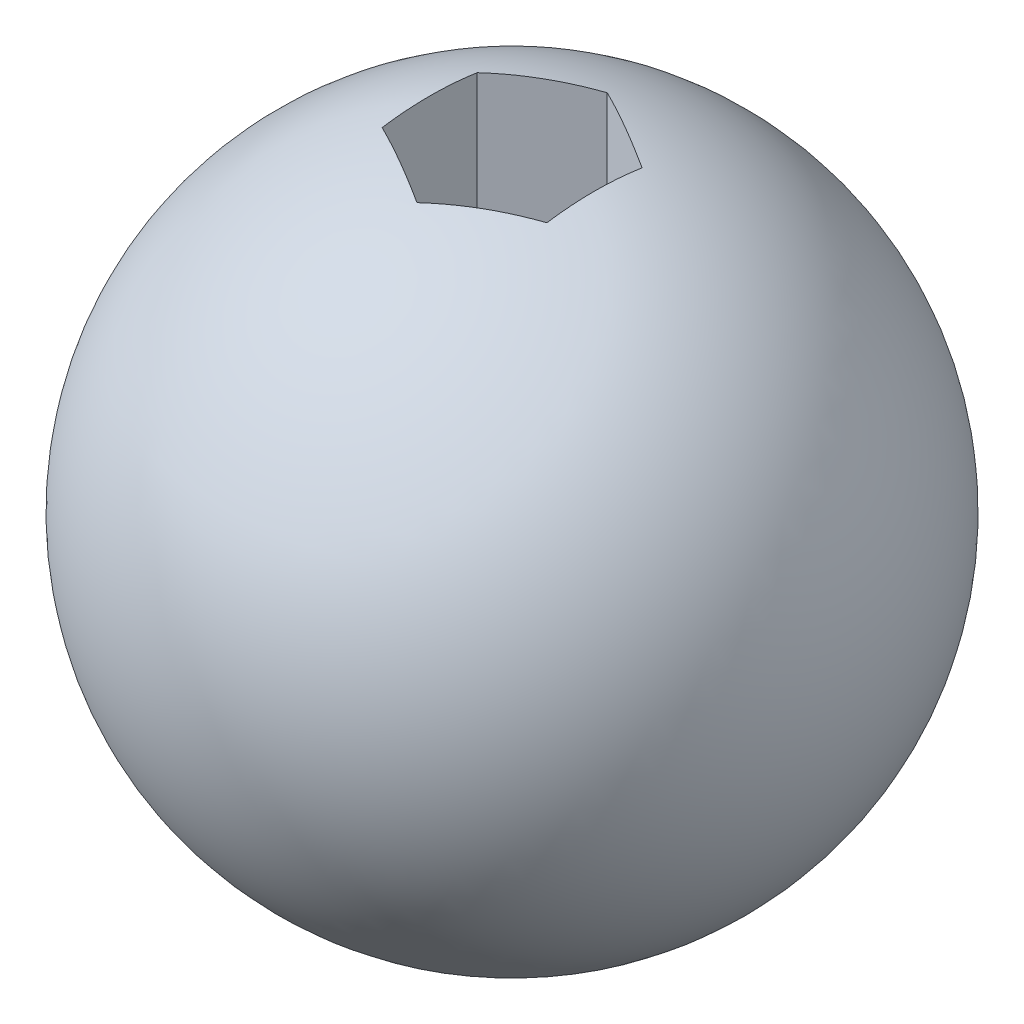
ISO-10303-21;
HEADER;
FILE_DESCRIPTION(('STEP AP214'),'2;1');
FILE_NAME('part.step','',(''),(''),'','','');
FILE_SCHEMA(('AUTOMOTIVE_DESIGN { 1 0 10303 214 1 1 1 1 }'));
ENDSEC;
DATA;
#1=APPLICATION_CONTEXT('core data for automotive mechanical design processes');
#2=APPLICATION_PROTOCOL_DEFINITION('international standard','automotive_design',2000,#1);
#3=PRODUCT_CONTEXT('',#1,'mechanical');
#4=PRODUCT('Part','Part','',(#3));
#5=PRODUCT_RELATED_PRODUCT_CATEGORY('part','',(#4));
#6=PRODUCT_DEFINITION_FORMATION('','',#4);
#7=PRODUCT_DEFINITION_CONTEXT('part definition',#1,'design');
#8=PRODUCT_DEFINITION('design','',#6,#7);
#9=PRODUCT_DEFINITION_SHAPE('','',#8);
#10=(LENGTH_UNIT() NAMED_UNIT(*) SI_UNIT(.MILLI.,.METRE.));
#11=(NAMED_UNIT(*) PLANE_ANGLE_UNIT() SI_UNIT($,.RADIAN.));
#12=(NAMED_UNIT(*) SI_UNIT($,.STERADIAN.) SOLID_ANGLE_UNIT());
#13=UNCERTAINTY_MEASURE_WITH_UNIT(LENGTH_MEASURE(1.E-05),#10,'distance_accuracy_value','');
#14=(GEOMETRIC_REPRESENTATION_CONTEXT(3) GLOBAL_UNCERTAINTY_ASSIGNED_CONTEXT((#13)) GLOBAL_UNIT_ASSIGNED_CONTEXT((#10,
#11,#12)) REPRESENTATION_CONTEXT('',''));
#15=CARTESIAN_POINT('',(0.,0.,0.));
#16=DIRECTION('',(0.,0.,1.));
#17=DIRECTION('',(1.,0.,0.));
#18=AXIS2_PLACEMENT_3D('',#15,#16,#17);
#19=CARTESIAN_POINT('',(0.,0.,0.));
#20=DIRECTION('',(0.,1.,0.));
#21=DIRECTION('',(1.,0.,0.));
#22=AXIS2_PLACEMENT_3D('',#19,#20,#21);
#23=SPHERICAL_SURFACE('',#22,20.);
#24=CARTESIAN_POINT('',(2.5,0.,4.3301270189222));
#25=DIRECTION('',(-0.5,0.,-0.866025403784438));
#26=DIRECTION('',(-0.866025403784438,0.,0.5));
#27=AXIS2_PLACEMENT_3D('',#24,#25,#26);
#28=CIRCLE('',#27,19.3649167310371);
#29=CARTESIAN_POINT('',(0.,19.1485421551268,5.77350269189626));
#30=VERTEX_POINT('',#29);
#31=CARTESIAN_POINT('',(5.,19.1485421551268,2.88675134594813));
#32=VERTEX_POINT('',#31);
#33=EDGE_CURVE('E55',#30,#32,#28,.T.);
#34=ORIENTED_EDGE('',*,*,#33,.F.);
#35=CARTESIAN_POINT('',(-2.5,0.,4.3301270189222));
#36=DIRECTION('',(0.5,0.,-0.866025403784438));
#37=DIRECTION('',(-0.866025403784439,0.,-0.5));
#38=AXIS2_PLACEMENT_3D('',#35,#36,#37);
#39=CIRCLE('',#38,19.3649167310371);
#40=CARTESIAN_POINT('',(-5.,19.1485421551268,2.88675134594813));
#41=VERTEX_POINT('',#40);
#42=EDGE_CURVE('E91',#41,#30,#39,.T.);
#43=ORIENTED_EDGE('',*,*,#42,.F.);
#44=CARTESIAN_POINT('',(-5.00000000000001,0.,0.));
#45=DIRECTION('',(1.,0.,0.));
#46=DIRECTION('',(0.,0.,-1.));
#47=AXIS2_PLACEMENT_3D('',#44,#45,#46);
#48=CIRCLE('',#47,19.3649167310371);
#49=CARTESIAN_POINT('',(-5.,19.1485421551268,-2.88675134594813));
#50=VERTEX_POINT('',#49);
#51=EDGE_CURVE('E128',#50,#41,#48,.T.);
#52=ORIENTED_EDGE('',*,*,#51,.F.);
#53=CARTESIAN_POINT('',(-2.5,0.,-4.3301270189222));
#54=DIRECTION('',(0.5,0.,0.866025403784439));
#55=DIRECTION('',(0.866025403784439,0.,-0.5));
#56=AXIS2_PLACEMENT_3D('',#53,#54,#55);
#57=CIRCLE('',#56,19.3649167310371);
#58=CARTESIAN_POINT('',(0.,19.1485421551268,-5.77350269189626));
#59=VERTEX_POINT('',#58);
#60=EDGE_CURVE('E130',#59,#50,#57,.T.);
#61=ORIENTED_EDGE('',*,*,#60,.F.);
#62=CARTESIAN_POINT('',(2.5,0.,-4.3301270189222));
#63=DIRECTION('',(-0.5,0.,0.866025403784439));
#64=DIRECTION('',(0.866025403784439,0.,0.5));
#65=AXIS2_PLACEMENT_3D('',#62,#63,#64);
#66=CIRCLE('',#65,19.3649167310371);
#67=CARTESIAN_POINT('',(5.,19.1485421551268,-2.88675134594813));
#68=VERTEX_POINT('',#67);
#69=EDGE_CURVE('E132',#68,#59,#66,.T.);
#70=ORIENTED_EDGE('',*,*,#69,.F.);
#71=CARTESIAN_POINT('',(5.,0.,0.));
#72=DIRECTION('',(-1.,0.,0.));
#73=DIRECTION('',(0.,0.,1.));
#74=AXIS2_PLACEMENT_3D('',#71,#72,#73);
#75=CIRCLE('',#74,19.3649167310371);
#76=EDGE_CURVE('E134',#32,#68,#75,.T.);
#77=ORIENTED_EDGE('',*,*,#76,.F.);
#78=EDGE_LOOP('',(#34,#43,#52,#61,#70,#77));
#79=FACE_BOUND('',#78,.T.);
#80=CARTESIAN_POINT('',(0.,-16.,0.));
#81=DIRECTION('',(0.,-1.,0.));
#82=DIRECTION('',(1.,0.,0.));
#83=AXIS2_PLACEMENT_3D('',#80,#81,#82);
#84=CIRCLE('',#83,12.);
#85=CARTESIAN_POINT('',(12.,-16.,0.));
#86=VERTEX_POINT('',#85);
#87=EDGE_CURVE('E11',#86,#86,#84,.T.);
#88=ORIENTED_EDGE('',*,*,#87,.F.);
#89=EDGE_LOOP('',(#88));
#90=FACE_BOUND('',#89,.T.);
#91=ADVANCED_FACE('F32',(#79,#90),#23,.T.);
#92=CARTESIAN_POINT('',(0.,-20.,0.));
#93=DIRECTION('',(0.,1.,0.));
#94=DIRECTION('',(0.,0.,1.));
#95=AXIS2_PLACEMENT_3D('',#92,#93,#94);
#96=CYLINDRICAL_SURFACE('',#95,3.);
#97=CARTESIAN_POINT('',(0.,0.,0.));
#98=DIRECTION('',(0.,1.,0.));
#99=DIRECTION('',(0.,0.,1.));
#100=AXIS2_PLACEMENT_3D('',#97,#98,#99);
#101=CIRCLE('',#100,3.);
#102=CARTESIAN_POINT('',(0.,0.,3.));
#103=VERTEX_POINT('',#102);
#104=EDGE_CURVE('E107',#103,#103,#101,.T.);
#105=ORIENTED_EDGE('',*,*,#104,.T.);
#106=EDGE_LOOP('',(#105));
#107=FACE_BOUND('',#106,.T.);
#108=CARTESIAN_POINT('',(0.,-16.,0.));
#109=DIRECTION('',(0.,-1.,0.));
#110=DIRECTION('',(1.,0.,0.));
#111=AXIS2_PLACEMENT_3D('',#108,#109,#110);
#112=CIRCLE('',#111,3.);
#113=CARTESIAN_POINT('',(3.,-16.,0.));
#114=VERTEX_POINT('',#113);
#115=EDGE_CURVE('E35',#114,#114,#112,.F.);
#116=ORIENTED_EDGE('',*,*,#115,.F.);
#117=EDGE_LOOP('',(#116));
#118=FACE_BOUND('',#117,.T.);
#119=ADVANCED_FACE('F141',(#107,#118),#96,.F.);
#120=CARTESIAN_POINT('',(0.,20.,5.77350269189626));
#121=DIRECTION('',(-0.5,0.,-0.866025403784438));
#122=DIRECTION('',(-0.866025403784438,0.,0.5));
#123=AXIS2_PLACEMENT_3D('',#120,#121,#122);
#124=PLANE('',#123);
#125=ORIENTED_EDGE('',*,*,#33,.T.);
#126=DIRECTION('',(0.,-1.,0.));
#127=VECTOR('',#126,1.);
#128=CARTESIAN_POINT('',(5.,20.,2.88675134594813));
#129=LINE('',#128,#127);
#130=CARTESIAN_POINT('',(5.,0.,2.88675134594813));
#131=VERTEX_POINT('',#130);
#132=EDGE_CURVE('E84',#32,#131,#129,.T.);
#133=ORIENTED_EDGE('',*,*,#132,.T.);
#134=DIRECTION('',(0.866025403784438,0.,-0.5));
#135=VECTOR('',#134,1.);
#136=CARTESIAN_POINT('',(0.,0.,5.77350269189626));
#137=LINE('',#136,#135);
#138=CARTESIAN_POINT('',(0.,0.,5.77350269189626));
#139=VERTEX_POINT('',#138);
#140=EDGE_CURVE('E88',#139,#131,#137,.T.);
#141=ORIENTED_EDGE('',*,*,#140,.F.);
#142=DIRECTION('',(0.,-1.,0.));
#143=VECTOR('',#142,1.);
#144=CARTESIAN_POINT('',(0.,20.,5.77350269189626));
#145=LINE('',#144,#143);
#146=EDGE_CURVE('E119',#30,#139,#145,.T.);
#147=ORIENTED_EDGE('',*,*,#146,.F.);
#148=EDGE_LOOP('',(#125,#133,#141,#147));
#149=FACE_BOUND('',#148,.T.);
#150=ADVANCED_FACE('F86',(#149),#124,.T.);
#151=CARTESIAN_POINT('',(5.,20.,2.88675134594813));
#152=DIRECTION('',(-1.,0.,0.));
#153=DIRECTION('',(0.,0.,1.));
#154=AXIS2_PLACEMENT_3D('',#151,#152,#153);
#155=PLANE('',#154);
#156=ORIENTED_EDGE('',*,*,#76,.T.);
#157=DIRECTION('',(0.,-1.,0.));
#158=VECTOR('',#157,1.);
#159=CARTESIAN_POINT('',(5.,20.,-2.88675134594813));
#160=LINE('',#159,#158);
#161=CARTESIAN_POINT('',(5.,0.,-2.88675134594813));
#162=VERTEX_POINT('',#161);
#163=EDGE_CURVE('E92',#68,#162,#160,.T.);
#164=ORIENTED_EDGE('',*,*,#163,.T.);
#165=DIRECTION('',(0.,0.,-1.));
#166=VECTOR('',#165,1.);
#167=CARTESIAN_POINT('',(5.,0.,2.88675134594813));
#168=LINE('',#167,#166);
#169=EDGE_CURVE('E95',#131,#162,#168,.T.);
#170=ORIENTED_EDGE('',*,*,#169,.F.);
#171=ORIENTED_EDGE('',*,*,#132,.F.);
#172=EDGE_LOOP('',(#156,#164,#170,#171));
#173=FACE_BOUND('',#172,.T.);
#174=ADVANCED_FACE('F96',(#173),#155,.T.);
#175=CARTESIAN_POINT('',(5.,20.,-2.88675134594813));
#176=DIRECTION('',(-0.5,0.,0.866025403784439));
#177=DIRECTION('',(0.866025403784439,0.,0.5));
#178=AXIS2_PLACEMENT_3D('',#175,#176,#177);
#179=PLANE('',#178);
#180=ORIENTED_EDGE('',*,*,#69,.T.);
#181=DIRECTION('',(0.,-1.,0.));
#182=VECTOR('',#181,1.);
#183=CARTESIAN_POINT('',(0.,20.,-5.77350269189626));
#184=LINE('',#183,#182);
#185=CARTESIAN_POINT('',(0.,0.,-5.77350269189626));
#186=VERTEX_POINT('',#185);
#187=EDGE_CURVE('E124',#59,#186,#184,.T.);
#188=ORIENTED_EDGE('',*,*,#187,.T.);
#189=DIRECTION('',(-0.866025403784438,0.,-0.5));
#190=VECTOR('',#189,1.);
#191=CARTESIAN_POINT('',(5.,0.,-2.88675134594813));
#192=LINE('',#191,#190);
#193=EDGE_CURVE('E101',#162,#186,#192,.T.);
#194=ORIENTED_EDGE('',*,*,#193,.F.);
#195=ORIENTED_EDGE('',*,*,#163,.F.);
#196=EDGE_LOOP('',(#180,#188,#194,#195));
#197=FACE_BOUND('',#196,.T.);
#198=ADVANCED_FACE('F165',(#197),#179,.T.);
#199=CARTESIAN_POINT('',(0.,20.,-5.77350269189626));
#200=DIRECTION('',(0.5,0.,0.866025403784439));
#201=DIRECTION('',(0.866025403784439,0.,-0.5));
#202=AXIS2_PLACEMENT_3D('',#199,#200,#201);
#203=PLANE('',#202);
#204=ORIENTED_EDGE('',*,*,#60,.T.);
#205=DIRECTION('',(0.,-1.,0.));
#206=VECTOR('',#205,1.);
#207=CARTESIAN_POINT('',(-5.,20.,-2.88675134594813));
#208=LINE('',#207,#206);
#209=CARTESIAN_POINT('',(-5.,0.,-2.88675134594813));
#210=VERTEX_POINT('',#209);
#211=EDGE_CURVE('E122',#50,#210,#208,.T.);
#212=ORIENTED_EDGE('',*,*,#211,.T.);
#213=DIRECTION('',(-0.866025403784439,0.,0.5));
#214=VECTOR('',#213,1.);
#215=CARTESIAN_POINT('',(0.,0.,-5.77350269189626));
#216=LINE('',#215,#214);
#217=EDGE_CURVE('E113',#186,#210,#216,.T.);
#218=ORIENTED_EDGE('',*,*,#217,.F.);
#219=ORIENTED_EDGE('',*,*,#187,.F.);
#220=EDGE_LOOP('',(#204,#212,#218,#219));
#221=FACE_BOUND('',#220,.T.);
#222=ADVANCED_FACE('F161',(#221),#203,.T.);
#223=CARTESIAN_POINT('',(-5.,20.,-2.88675134594813));
#224=DIRECTION('',(1.,0.,0.));
#225=DIRECTION('',(0.,0.,-1.));
#226=AXIS2_PLACEMENT_3D('',#223,#224,#225);
#227=PLANE('',#226);
#228=ORIENTED_EDGE('',*,*,#51,.T.);
#229=DIRECTION('',(0.,-1.,0.));
#230=VECTOR('',#229,1.);
#231=CARTESIAN_POINT('',(-5.00000000000001,20.,2.88675134594813));
#232=LINE('',#231,#230);
#233=CARTESIAN_POINT('',(-5.00000000000001,0.,2.88675134594813));
#234=VERTEX_POINT('',#233);
#235=EDGE_CURVE('E47',#41,#234,#232,.T.);
#236=ORIENTED_EDGE('',*,*,#235,.T.);
#237=DIRECTION('',(0.,0.,1.));
#238=VECTOR('',#237,1.);
#239=CARTESIAN_POINT('',(-5.,0.,-2.88675134594813));
#240=LINE('',#239,#238);
#241=EDGE_CURVE('E116',#210,#234,#240,.T.);
#242=ORIENTED_EDGE('',*,*,#241,.F.);
#243=ORIENTED_EDGE('',*,*,#211,.F.);
#244=EDGE_LOOP('',(#228,#236,#242,#243));
#245=FACE_BOUND('',#244,.T.);
#246=ADVANCED_FACE('F158',(#245),#227,.T.);
#247=CARTESIAN_POINT('',(-5.00000000000001,20.,2.88675134594813));
#248=DIRECTION('',(0.5,0.,-0.866025403784438));
#249=DIRECTION('',(-0.866025403784439,0.,-0.5));
#250=AXIS2_PLACEMENT_3D('',#247,#248,#249);
#251=PLANE('',#250);
#252=ORIENTED_EDGE('',*,*,#42,.T.);
#253=ORIENTED_EDGE('',*,*,#146,.T.);
#254=DIRECTION('',(0.866025403784439,0.,0.5));
#255=VECTOR('',#254,1.);
#256=CARTESIAN_POINT('',(-5.00000000000001,0.,2.88675134594813));
#257=LINE('',#256,#255);
#258=EDGE_CURVE('E106',#234,#139,#257,.T.);
#259=ORIENTED_EDGE('',*,*,#258,.F.);
#260=ORIENTED_EDGE('',*,*,#235,.F.);
#261=EDGE_LOOP('',(#252,#253,#259,#260));
#262=FACE_BOUND('',#261,.T.);
#263=ADVANCED_FACE('F154',(#262),#251,.T.);
#264=CARTESIAN_POINT('',(0.,0.,0.));
#265=DIRECTION('',(0.,1.,0.));
#266=DIRECTION('',(0.,0.,1.));
#267=AXIS2_PLACEMENT_3D('',#264,#265,#266);
#268=PLANE('',#267);
#269=ORIENTED_EDGE('',*,*,#104,.F.);
#270=EDGE_LOOP('',(#269));
#271=FACE_BOUND('',#270,.T.);
#272=ORIENTED_EDGE('',*,*,#140,.T.);
#273=ORIENTED_EDGE('',*,*,#169,.T.);
#274=ORIENTED_EDGE('',*,*,#193,.T.);
#275=ORIENTED_EDGE('',*,*,#217,.T.);
#276=ORIENTED_EDGE('',*,*,#241,.T.);
#277=ORIENTED_EDGE('',*,*,#258,.T.);
#278=EDGE_LOOP('',(#272,#273,#274,#275,#276,#277));
#279=FACE_BOUND('',#278,.T.);
#280=ADVANCED_FACE('F104',(#271,#279),#268,.T.);
#281=CARTESIAN_POINT('',(31.7268595936184,-16.,89.7353991960793));
#282=DIRECTION('',(0.,-1.,0.));
#283=DIRECTION('',(1.,0.,0.));
#284=AXIS2_PLACEMENT_3D('',#281,#282,#283);
#285=PLANE('',#284);
#286=ORIENTED_EDGE('',*,*,#115,.T.);
#287=EDGE_LOOP('',(#286));
#288=FACE_BOUND('',#287,.T.);
#289=ORIENTED_EDGE('',*,*,#87,.T.);
#290=EDGE_LOOP('',(#289));
#291=FACE_BOUND('',#290,.T.);
#292=ADVANCED_FACE('F138',(#288,#291),#285,.T.);
#293=CLOSED_SHELL('',(#91,#119,#150,#174,#198,#222,#246,#263,#280,#292));
#294=MANIFOLD_SOLID_BREP('B2',#293);
#295=ADVANCED_BREP_SHAPE_REPRESENTATION('',(#18,#294),#14);
#296=SHAPE_DEFINITION_REPRESENTATION(#9,#295);
ENDSEC;
END-ISO-10303-21;
